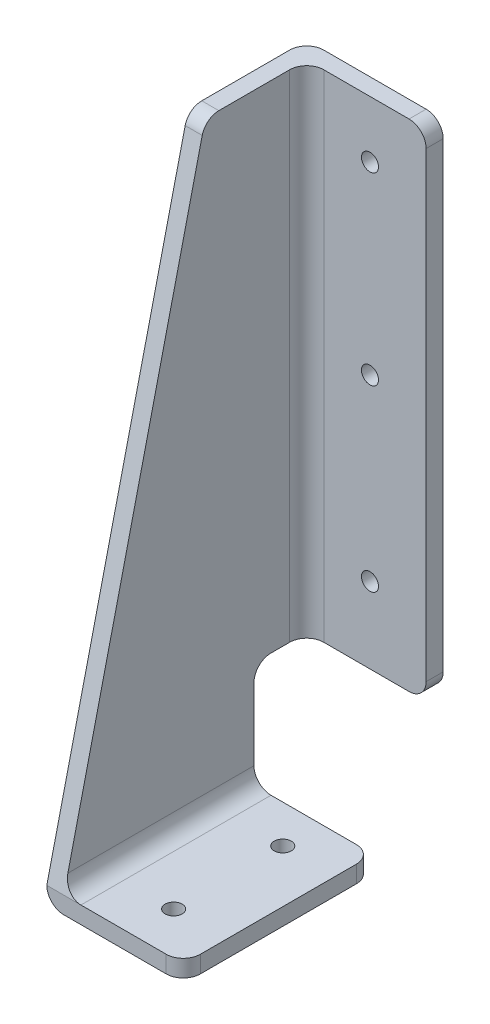
ISO-10303-21;
HEADER;
FILE_DESCRIPTION(('STEP AP214'),'2;1');
FILE_NAME('part.step','',(''),(''),'','','');
FILE_SCHEMA(('AUTOMOTIVE_DESIGN { 1 0 10303 214 1 1 1 1 }'));
ENDSEC;
DATA;
#1=APPLICATION_CONTEXT('core data for automotive mechanical design processes');
#2=APPLICATION_PROTOCOL_DEFINITION('international standard','automotive_design',2000,#1);
#3=PRODUCT_CONTEXT('',#1,'mechanical');
#4=PRODUCT('Part','Part','',(#3));
#5=PRODUCT_RELATED_PRODUCT_CATEGORY('part','',(#4));
#6=PRODUCT_DEFINITION_FORMATION('','',#4);
#7=PRODUCT_DEFINITION_CONTEXT('part definition',#1,'design');
#8=PRODUCT_DEFINITION('design','',#6,#7);
#9=PRODUCT_DEFINITION_SHAPE('','',#8);
#10=(LENGTH_UNIT() NAMED_UNIT(*) SI_UNIT(.MILLI.,.METRE.));
#11=(NAMED_UNIT(*) PLANE_ANGLE_UNIT() SI_UNIT($,.RADIAN.));
#12=(NAMED_UNIT(*) SI_UNIT($,.STERADIAN.) SOLID_ANGLE_UNIT());
#13=UNCERTAINTY_MEASURE_WITH_UNIT(LENGTH_MEASURE(1.E-05),#10,'distance_accuracy_value','');
#14=(GEOMETRIC_REPRESENTATION_CONTEXT(3) GLOBAL_UNCERTAINTY_ASSIGNED_CONTEXT((#13)) GLOBAL_UNIT_ASSIGNED_CONTEXT((#10,
#11,#12)) REPRESENTATION_CONTEXT('',''));
#15=CARTESIAN_POINT('',(0.,0.,0.));
#16=DIRECTION('',(0.,0.,1.));
#17=DIRECTION('',(1.,0.,0.));
#18=AXIS2_PLACEMENT_3D('',#15,#16,#17);
#19=CARTESIAN_POINT('',(-150.,37.1958630641374,158.305593200969));
#20=DIRECTION('',(0.,0.228733344690251,0.973489115001709));
#21=DIRECTION('',(0.,-0.973489115001709,0.228733344690251));
#22=AXIS2_PLACEMENT_3D('',#19,#20,#21);
#23=PLANE('',#22);
#24=DIRECTION('',(0.,-0.973489115001709,0.228733344690251));
#25=VECTOR('',#24,1.);
#26=CARTESIAN_POINT('',(-140.,37.1958630641374,158.305593200969));
#27=LINE('',#26,#25);
#28=CARTESIAN_POINT('',(-140.,365.139019254695,81.25128018627));
#29=VERTEX_POINT('',#28);
#30=CARTESIAN_POINT('',(-140.,30.,159.996350499873));
#31=VERTEX_POINT('',#30);
#32=EDGE_CURVE('E324',#29,#31,#27,.T.);
#33=ORIENTED_EDGE('',*,*,#32,.F.);
#34=DIRECTION('',(1.,0.,0.));
#35=VECTOR('',#34,1.);
#36=CARTESIAN_POINT('',(-150.,365.139019254695,81.25128018627));
#37=LINE('',#36,#35);
#38=CARTESIAN_POINT('',(-150.,365.139019254695,81.25128018627));
#39=VERTEX_POINT('',#38);
#40=EDGE_CURVE('E199',#29,#39,#37,.F.);
#41=ORIENTED_EDGE('',*,*,#40,.T.);
#42=DIRECTION('',(0.,-0.973489115001709,0.228733344690251));
#43=VECTOR('',#42,1.);
#44=CARTESIAN_POINT('',(-150.,37.1958630641374,158.305593200969));
#45=LINE('',#44,#43);
#46=CARTESIAN_POINT('',(-150.,20.,162.345974560024));
#47=VERTEX_POINT('',#46);
#48=EDGE_CURVE('E183',#39,#47,#45,.T.);
#49=ORIENTED_EDGE('',*,*,#48,.T.);
#50=DIRECTION('',(1.,0.,0.));
#51=VECTOR('',#50,1.);
#52=CARTESIAN_POINT('',(-150.,20.,162.345974560024));
#53=LINE('',#52,#51);
#54=CARTESIAN_POINT('',(-130.,20.,162.345974560024));
#55=VERTEX_POINT('',#54);
#56=EDGE_CURVE('E196',#47,#55,#53,.T.);
#57=ORIENTED_EDGE('',*,*,#56,.T.);
#58=CARTESIAN_POINT('',(-130.,30.,159.996350499873));
#59=DIRECTION('',(0.,0.228733344690251,0.973489115001709));
#60=DIRECTION('',(0.,-0.973489115001709,0.228733344690251));
#61=AXIS2_PLACEMENT_3D('',#58,#59,#60);
#62=ELLIPSE('',#61,10.27232852006,10.);
#63=EDGE_CURVE('E241',#55,#31,#62,.F.);
#64=ORIENTED_EDGE('',*,*,#63,.T.);
#65=EDGE_LOOP('',(#33,#41,#49,#57,#64));
#66=FACE_BOUND('',#65,.T.);
#67=ADVANCED_FACE('F44',(#66),#23,.T.);
#68=CARTESIAN_POINT('',(-130.,30.,0.));
#69=DIRECTION('',(0.,0.,1.));
#70=DIRECTION('',(1.,0.,0.));
#71=AXIS2_PLACEMENT_3D('',#68,#69,#70);
#72=CYLINDRICAL_SURFACE('',#71,10.);
#73=ORIENTED_EDGE('',*,*,#63,.F.);
#74=DIRECTION('',(0.,0.,-1.));
#75=VECTOR('',#74,1.);
#76=CARTESIAN_POINT('',(-130.,20.,162.345974560024));
#77=LINE('',#76,#75);
#78=CARTESIAN_POINT('',(-130.,20.,50.9191264101943));
#79=VERTEX_POINT('',#78);
#80=EDGE_CURVE('E340',#79,#55,#77,.F.);
#81=ORIENTED_EDGE('',*,*,#80,.F.);
#82=CARTESIAN_POINT('',(-130.,30.,50.9191264101943));
#83=DIRECTION('',(0.,0.,-1.));
#84=DIRECTION('',(-1.,0.,0.));
#85=AXIS2_PLACEMENT_3D('',#82,#83,#84);
#86=CIRCLE('',#85,10.);
#87=CARTESIAN_POINT('',(-140.,30.,50.9191264101943));
#88=VERTEX_POINT('',#87);
#89=EDGE_CURVE('E239',#88,#79,#86,.F.);
#90=ORIENTED_EDGE('',*,*,#89,.F.);
#91=DIRECTION('',(0.,0.,-1.));
#92=VECTOR('',#91,1.);
#93=CARTESIAN_POINT('',(-140.,30.,50.9191264101943));
#94=LINE('',#93,#92);
#95=EDGE_CURVE('E333',#31,#88,#94,.T.);
#96=ORIENTED_EDGE('',*,*,#95,.F.);
#97=EDGE_LOOP('',(#73,#81,#90,#96));
#98=FACE_BOUND('',#97,.T.);
#99=ADVANCED_FACE('F398',(#98),#72,.F.);
#100=CARTESIAN_POINT('',(-150.,72.1964727267462,40.9191264101943));
#101=DIRECTION('',(-1.,0.,0.));
#102=DIRECTION('',(0.,0.,1.));
#103=AXIS2_PLACEMENT_3D('',#100,#101,#102);
#104=CYLINDRICAL_SURFACE('',#103,10.);
#105=CARTESIAN_POINT('',(-150.,72.1964727267462,40.9191264101943));
#106=DIRECTION('',(1.,0.,0.));
#107=DIRECTION('',(0.,0.,-1.));
#108=AXIS2_PLACEMENT_3D('',#105,#106,#107);
#109=CIRCLE('',#108,10.);
#110=CARTESIAN_POINT('',(-150.,82.1964727267462,40.9191264101943));
#111=VERTEX_POINT('',#110);
#112=CARTESIAN_POINT('',(-150.,72.1964727267462,50.9191264101943));
#113=VERTEX_POINT('',#112);
#114=EDGE_CURVE('E245',#111,#113,#109,.T.);
#115=ORIENTED_EDGE('',*,*,#114,.F.);
#116=DIRECTION('',(1.,0.,0.));
#117=VECTOR('',#116,1.);
#118=CARTESIAN_POINT('',(-150.,82.1964727267462,40.9191264101943));
#119=LINE('',#118,#117);
#120=CARTESIAN_POINT('',(-140.,82.1964727267462,40.9191264101943));
#121=VERTEX_POINT('',#120);
#122=EDGE_CURVE('E360',#121,#111,#119,.F.);
#123=ORIENTED_EDGE('',*,*,#122,.F.);
#124=CARTESIAN_POINT('',(-140.,72.1964727267462,40.9191264101943));
#125=DIRECTION('',(1.,0.,0.));
#126=DIRECTION('',(0.,0.,-1.));
#127=AXIS2_PLACEMENT_3D('',#124,#125,#126);
#128=CIRCLE('',#127,10.);
#129=CARTESIAN_POINT('',(-140.,72.1964727267462,50.9191264101943));
#130=VERTEX_POINT('',#129);
#131=EDGE_CURVE('E243',#130,#121,#128,.F.);
#132=ORIENTED_EDGE('',*,*,#131,.F.);
#133=DIRECTION('',(1.,0.,0.));
#134=VECTOR('',#133,1.);
#135=CARTESIAN_POINT('',(-140.,72.1964727267462,50.9191264101943));
#136=LINE('',#135,#134);
#137=EDGE_CURVE('E368',#113,#130,#136,.T.);
#138=ORIENTED_EDGE('',*,*,#137,.F.);
#139=EDGE_LOOP('',(#115,#123,#132,#138));
#140=FACE_BOUND('',#139,.T.);
#141=ADVANCED_FACE('F443',(#140),#104,.F.);
#142=CARTESIAN_POINT('',(-130.,0.,30.));
#143=DIRECTION('',(0.,-1.,0.));
#144=DIRECTION('',(0.,0.,-1.));
#145=AXIS2_PLACEMENT_3D('',#142,#143,#144);
#146=CYLINDRICAL_SURFACE('',#145,10.);
#147=CARTESIAN_POINT('',(-130.,82.1964727267462,30.));
#148=DIRECTION('',(0.,-1.,0.));
#149=DIRECTION('',(0.,0.,-1.));
#150=AXIS2_PLACEMENT_3D('',#147,#148,#149);
#151=CIRCLE('',#150,10.);
#152=CARTESIAN_POINT('',(-130.,82.1964727267462,20.));
#153=VERTEX_POINT('',#152);
#154=CARTESIAN_POINT('',(-140.,82.1964727267462,30.));
#155=VERTEX_POINT('',#154);
#156=EDGE_CURVE('E11',#153,#155,#151,.F.);
#157=ORIENTED_EDGE('',*,*,#156,.F.);
#158=DIRECTION('',(0.,1.,0.));
#159=VECTOR('',#158,1.);
#160=CARTESIAN_POINT('',(-130.,82.1964727267462,20.));
#161=LINE('',#160,#159);
#162=CARTESIAN_POINT('',(-130.,372.851685807793,20.));
#163=VERTEX_POINT('',#162);
#164=EDGE_CURVE('E234',#163,#153,#161,.F.);
#165=ORIENTED_EDGE('',*,*,#164,.F.);
#166=CARTESIAN_POINT('',(-130.,372.851685807793,30.));
#167=DIRECTION('',(0.,1.,0.));
#168=DIRECTION('',(0.,0.,1.));
#169=AXIS2_PLACEMENT_3D('',#166,#167,#168);
#170=CIRCLE('',#169,10.);
#171=CARTESIAN_POINT('',(-140.,372.851685807793,30.));
#172=VERTEX_POINT('',#171);
#173=EDGE_CURVE('E54',#172,#163,#170,.F.);
#174=ORIENTED_EDGE('',*,*,#173,.F.);
#175=DIRECTION('',(0.,1.,0.));
#176=VECTOR('',#175,1.);
#177=CARTESIAN_POINT('',(-140.,372.851685807793,30.));
#178=LINE('',#177,#176);
#179=EDGE_CURVE('E330',#155,#172,#178,.T.);
#180=ORIENTED_EDGE('',*,*,#179,.F.);
#181=EDGE_LOOP('',(#157,#165,#174,#180));
#182=FACE_BOUND('',#181,.T.);
#183=ADVANCED_FACE('F439',(#182),#146,.F.);
#184=CARTESIAN_POINT('',(-140.,0.,0.));
#185=DIRECTION('',(1.,0.,0.));
#186=DIRECTION('',(0.,0.,-1.));
#187=AXIS2_PLACEMENT_3D('',#184,#185,#186);
#188=PLANE('',#187);
#189=ORIENTED_EDGE('',*,*,#32,.T.);
#190=ORIENTED_EDGE('',*,*,#95,.T.);
#191=DIRECTION('',(0.,1.,0.));
#192=VECTOR('',#191,1.);
#193=CARTESIAN_POINT('',(-140.,0.,50.9191264101943));
#194=LINE('',#193,#192);
#195=EDGE_CURVE('E315',#88,#130,#194,.T.);
#196=ORIENTED_EDGE('',*,*,#195,.T.);
#197=ORIENTED_EDGE('',*,*,#131,.T.);
#198=DIRECTION('',(0.,0.,-1.));
#199=VECTOR('',#198,1.);
#200=CARTESIAN_POINT('',(-140.,82.1964727267462,0.));
#201=LINE('',#200,#199);
#202=EDGE_CURVE('E311',#121,#155,#201,.T.);
#203=ORIENTED_EDGE('',*,*,#202,.T.);
#204=ORIENTED_EDGE('',*,*,#179,.T.);
#205=DIRECTION('',(0.,0.,1.));
#206=VECTOR('',#205,1.);
#207=CARTESIAN_POINT('',(-140.,372.851685807793,0.));
#208=LINE('',#207,#206);
#209=CARTESIAN_POINT('',(-140.,372.851685807793,71.5163890362529));
#210=VERTEX_POINT('',#209);
#211=EDGE_CURVE('E321',#172,#210,#208,.T.);
#212=ORIENTED_EDGE('',*,*,#211,.T.);
#213=CARTESIAN_POINT('',(-140.,362.851685807793,71.5163890362529));
#214=DIRECTION('',(1.,0.,0.));
#215=DIRECTION('',(0.,0.,-1.));
#216=AXIS2_PLACEMENT_3D('',#213,#214,#215);
#217=CIRCLE('',#216,10.);
#218=EDGE_CURVE('E211',#210,#29,#217,.T.);
#219=ORIENTED_EDGE('',*,*,#218,.T.);
#220=EDGE_LOOP('',(#189,#190,#196,#197,#203,#204,#212,#219));
#221=FACE_BOUND('',#220,.T.);
#222=ADVANCED_FACE('F401',(#221),#188,.T.);
#223=CARTESIAN_POINT('',(-150.,362.851685807793,71.5163890362529));
#224=DIRECTION('',(1.,0.,0.));
#225=DIRECTION('',(0.,0.,-1.));
#226=AXIS2_PLACEMENT_3D('',#223,#224,#225);
#227=CYLINDRICAL_SURFACE('',#226,10.);
#228=CARTESIAN_POINT('',(-150.,362.851685807793,71.5163890362529));
#229=DIRECTION('',(1.,0.,0.));
#230=DIRECTION('',(0.,0.,-1.));
#231=AXIS2_PLACEMENT_3D('',#228,#229,#230);
#232=CIRCLE('',#231,10.);
#233=CARTESIAN_POINT('',(-150.,372.851685807793,71.5163890362529));
#234=VERTEX_POINT('',#233);
#235=EDGE_CURVE('E190',#39,#234,#232,.F.);
#236=ORIENTED_EDGE('',*,*,#235,.F.);
#237=ORIENTED_EDGE('',*,*,#40,.F.);
#238=ORIENTED_EDGE('',*,*,#218,.F.);
#239=DIRECTION('',(1.,0.,0.));
#240=VECTOR('',#239,1.);
#241=CARTESIAN_POINT('',(-150.,372.851685807793,71.5163890362529));
#242=LINE('',#241,#240);
#243=EDGE_CURVE('E351',#234,#210,#242,.T.);
#244=ORIENTED_EDGE('',*,*,#243,.F.);
#245=EDGE_LOOP('',(#236,#237,#238,#244));
#246=FACE_BOUND('',#245,.T.);
#247=ADVANCED_FACE('F406',(#246),#227,.T.);
#248=CARTESIAN_POINT('',(-150.,0.,0.));
#249=DIRECTION('',(1.,0.,0.));
#250=DIRECTION('',(0.,0.,-1.));
#251=AXIS2_PLACEMENT_3D('',#248,#249,#250);
#252=PLANE('',#251);
#253=DIRECTION('',(0.,0.,1.));
#254=VECTOR('',#253,1.);
#255=CARTESIAN_POINT('',(-150.,372.851685807793,0.));
#256=LINE('',#255,#254);
#257=CARTESIAN_POINT('',(-150.,372.851685807793,20.));
#258=VERTEX_POINT('',#257);
#259=EDGE_CURVE('E200',#258,#234,#256,.T.);
#260=ORIENTED_EDGE('',*,*,#259,.F.);
#261=DIRECTION('',(0.,1.,0.));
#262=VECTOR('',#261,1.);
#263=CARTESIAN_POINT('',(-150.,0.,20.));
#264=LINE('',#263,#262);
#265=CARTESIAN_POINT('',(-150.,82.1964727267462,20.));
#266=VERTEX_POINT('',#265);
#267=EDGE_CURVE('E189',#258,#266,#264,.F.);
#268=ORIENTED_EDGE('',*,*,#267,.T.);
#269=DIRECTION('',(0.,0.,-1.));
#270=VECTOR('',#269,1.);
#271=CARTESIAN_POINT('',(-150.,82.1964727267462,0.));
#272=LINE('',#271,#270);
#273=EDGE_CURVE('E312',#111,#266,#272,.T.);
#274=ORIENTED_EDGE('',*,*,#273,.F.);
#275=ORIENTED_EDGE('',*,*,#114,.T.);
#276=DIRECTION('',(0.,1.,0.));
#277=VECTOR('',#276,1.);
#278=CARTESIAN_POINT('',(-150.,0.,50.9191264101943));
#279=LINE('',#278,#277);
#280=CARTESIAN_POINT('',(-150.,20.,50.9191264101943));
#281=VERTEX_POINT('',#280);
#282=EDGE_CURVE('E186',#281,#113,#279,.T.);
#283=ORIENTED_EDGE('',*,*,#282,.F.);
#284=DIRECTION('',(0.,0.,-1.));
#285=VECTOR('',#284,1.);
#286=CARTESIAN_POINT('',(-150.,20.,0.));
#287=LINE('',#286,#285);
#288=EDGE_CURVE('E179',#281,#47,#287,.F.);
#289=ORIENTED_EDGE('',*,*,#288,.T.);
#290=ORIENTED_EDGE('',*,*,#48,.F.);
#291=ORIENTED_EDGE('',*,*,#235,.T.);
#292=EDGE_LOOP('',(#260,#268,#274,#275,#283,#289,#290,#291));
#293=FACE_BOUND('',#292,.T.);
#294=ADVANCED_FACE('F182',(#293),#252,.F.);
#295=CARTESIAN_POINT('',(-70.,0.,0.));
#296=DIRECTION('',(1.,0.,0.));
#297=DIRECTION('',(0.,0.,-1.));
#298=AXIS2_PLACEMENT_3D('',#295,#296,#297);
#299=PLANE('',#298);
#300=DIRECTION('',(0.,0.,-1.));
#301=VECTOR('',#300,1.);
#302=CARTESIAN_POINT('',(-70.,10.,0.));
#303=LINE('',#302,#301);
#304=CARTESIAN_POINT('',(-70.,10.,152.345974560024));
#305=VERTEX_POINT('',#304);
#306=CARTESIAN_POINT('',(-70.,10.,60.9191264101943));
#307=VERTEX_POINT('',#306);
#308=EDGE_CURVE('E299',#305,#307,#303,.T.);
#309=ORIENTED_EDGE('',*,*,#308,.T.);
#310=DIRECTION('',(0.,1.,0.));
#311=VECTOR('',#310,1.);
#312=CARTESIAN_POINT('',(-70.,0.,60.9191264101943));
#313=LINE('',#312,#311);
#314=CARTESIAN_POINT('',(-70.,20.,60.9191264101943));
#315=VERTEX_POINT('',#314);
#316=EDGE_CURVE('E221',#307,#315,#313,.T.);
#317=ORIENTED_EDGE('',*,*,#316,.T.);
#318=DIRECTION('',(0.,0.,-1.));
#319=VECTOR('',#318,1.);
#320=CARTESIAN_POINT('',(-70.,20.,0.));
#321=LINE('',#320,#319);
#322=CARTESIAN_POINT('',(-70.,20.,152.345974560024));
#323=VERTEX_POINT('',#322);
#324=EDGE_CURVE('E296',#323,#315,#321,.T.);
#325=ORIENTED_EDGE('',*,*,#324,.F.);
#326=DIRECTION('',(0.,-1.,0.));
#327=VECTOR('',#326,1.);
#328=CARTESIAN_POINT('',(-70.,10.,152.345974560024));
#329=LINE('',#328,#327);
#330=EDGE_CURVE('E217',#323,#305,#329,.T.);
#331=ORIENTED_EDGE('',*,*,#330,.T.);
#332=EDGE_LOOP('',(#309,#317,#325,#331));
#333=FACE_BOUND('',#332,.T.);
#334=ADVANCED_FACE('F387',(#333),#299,.T.);
#335=CARTESIAN_POINT('',(-70.,0.,162.345974560024));
#336=DIRECTION('',(0.,0.,-1.));
#337=DIRECTION('',(-1.,0.,0.));
#338=AXIS2_PLACEMENT_3D('',#335,#336,#337);
#339=PLANE('',#338);
#340=ORIENTED_EDGE('',*,*,#56,.F.);
#341=CARTESIAN_POINT('',(-140.,20.,162.345974560024));
#342=DIRECTION('',(0.,0.,-1.));
#343=DIRECTION('',(-1.,0.,0.));
#344=AXIS2_PLACEMENT_3D('',#341,#342,#343);
#345=CIRCLE('',#344,10.);
#346=CARTESIAN_POINT('',(-140.,10.,162.345974560024));
#347=VERTEX_POINT('',#346);
#348=EDGE_CURVE('E206',#47,#347,#345,.F.);
#349=ORIENTED_EDGE('',*,*,#348,.T.);
#350=DIRECTION('',(-1.,0.,0.));
#351=VECTOR('',#350,1.);
#352=CARTESIAN_POINT('',(-70.,10.,162.345974560024));
#353=LINE('',#352,#351);
#354=CARTESIAN_POINT('',(-80.,10.,162.345974560024));
#355=VERTEX_POINT('',#354);
#356=EDGE_CURVE('E308',#355,#347,#353,.T.);
#357=ORIENTED_EDGE('',*,*,#356,.F.);
#358=DIRECTION('',(0.,-1.,0.));
#359=VECTOR('',#358,1.);
#360=CARTESIAN_POINT('',(-80.,20.,162.345974560024));
#361=LINE('',#360,#359);
#362=CARTESIAN_POINT('',(-80.,20.,162.345974560024));
#363=VERTEX_POINT('',#362);
#364=EDGE_CURVE('E218',#355,#363,#361,.F.);
#365=ORIENTED_EDGE('',*,*,#364,.T.);
#366=DIRECTION('',(-1.,0.,0.));
#367=VECTOR('',#366,1.);
#368=CARTESIAN_POINT('',(-70.,20.,162.345974560024));
#369=LINE('',#368,#367);
#370=EDGE_CURVE('E209',#363,#55,#369,.T.);
#371=ORIENTED_EDGE('',*,*,#370,.T.);
#372=EDGE_LOOP('',(#340,#349,#357,#365,#371));
#373=FACE_BOUND('',#372,.T.);
#374=ADVANCED_FACE('F204',(#373),#339,.F.);
#375=CARTESIAN_POINT('',(-70.,20.,0.));
#376=DIRECTION('',(0.,1.,0.));
#377=DIRECTION('',(0.,0.,1.));
#378=AXIS2_PLACEMENT_3D('',#375,#376,#377);
#379=PLANE('',#378);
#380=CARTESIAN_POINT('',(-100.798534583192,20.,73.2467031796124));
#381=DIRECTION('',(0.,1.,0.));
#382=DIRECTION('',(0.,0.,1.));
#383=AXIS2_PLACEMENT_3D('',#380,#381,#382);
#384=CIRCLE('',#383,4.99999999999999);
#385=CARTESIAN_POINT('',(-100.798534583192,20.,78.2467031796124));
#386=VERTEX_POINT('',#385);
#387=EDGE_CURVE('E264',#386,#386,#384,.T.);
#388=ORIENTED_EDGE('',*,*,#387,.F.);
#389=EDGE_LOOP('',(#388));
#390=FACE_BOUND('',#389,.T.);
#391=CARTESIAN_POINT('',(-100.798534583192,20.,137.208608221462));
#392=DIRECTION('',(0.,1.,0.));
#393=DIRECTION('',(0.,0.,1.));
#394=AXIS2_PLACEMENT_3D('',#391,#392,#393);
#395=CIRCLE('',#394,4.99999999999999);
#396=CARTESIAN_POINT('',(-100.798534583192,20.,142.208608221462));
#397=VERTEX_POINT('',#396);
#398=EDGE_CURVE('E254',#397,#397,#395,.T.);
#399=ORIENTED_EDGE('',*,*,#398,.F.);
#400=EDGE_LOOP('',(#399));
#401=FACE_BOUND('',#400,.T.);
#402=DIRECTION('',(-1.,0.,0.));
#403=VECTOR('',#402,1.);
#404=CARTESIAN_POINT('',(-70.,20.,50.9191264101943));
#405=LINE('',#404,#403);
#406=CARTESIAN_POINT('',(-80.,20.,50.9191264101943));
#407=VERTEX_POINT('',#406);
#408=EDGE_CURVE('E302',#407,#79,#405,.T.);
#409=ORIENTED_EDGE('',*,*,#408,.T.);
#410=ORIENTED_EDGE('',*,*,#80,.T.);
#411=ORIENTED_EDGE('',*,*,#370,.F.);
#412=CARTESIAN_POINT('',(-80.,20.,152.345974560024));
#413=DIRECTION('',(0.,1.,0.));
#414=DIRECTION('',(0.,0.,1.));
#415=AXIS2_PLACEMENT_3D('',#412,#413,#414);
#416=CIRCLE('',#415,10.);
#417=EDGE_CURVE('E336',#363,#323,#416,.T.);
#418=ORIENTED_EDGE('',*,*,#417,.T.);
#419=ORIENTED_EDGE('',*,*,#324,.T.);
#420=CARTESIAN_POINT('',(-80.,20.,60.9191264101943));
#421=DIRECTION('',(0.,1.,0.));
#422=DIRECTION('',(0.,0.,1.));
#423=AXIS2_PLACEMENT_3D('',#420,#421,#422);
#424=CIRCLE('',#423,10.);
#425=EDGE_CURVE('E338',#315,#407,#424,.T.);
#426=ORIENTED_EDGE('',*,*,#425,.T.);
#427=EDGE_LOOP('',(#409,#410,#411,#418,#419,#426));
#428=FACE_BOUND('',#427,.T.);
#429=ADVANCED_FACE('F395',(#390,#401,#428),#379,.T.);
#430=CARTESIAN_POINT('',(-100.798534583192,20.,73.2467031796124));
#431=DIRECTION('',(0.,1.,0.));
#432=DIRECTION('',(0.,0.,1.));
#433=AXIS2_PLACEMENT_3D('',#430,#431,#432);
#434=CYLINDRICAL_SURFACE('',#433,4.99999999999999);
#435=ORIENTED_EDGE('',*,*,#387,.T.);
#436=EDGE_LOOP('',(#435));
#437=FACE_BOUND('',#436,.T.);
#438=CARTESIAN_POINT('',(-100.798534583192,10.,73.2467031796124));
#439=DIRECTION('',(0.,1.,0.));
#440=DIRECTION('',(0.,0.,1.));
#441=AXIS2_PLACEMENT_3D('',#438,#439,#440);
#442=CIRCLE('',#441,4.99999999999999);
#443=CARTESIAN_POINT('',(-100.798534583192,10.,78.2467031796124));
#444=VERTEX_POINT('',#443);
#445=EDGE_CURVE('E48',#444,#444,#442,.T.);
#446=ORIENTED_EDGE('',*,*,#445,.F.);
#447=EDGE_LOOP('',(#446));
#448=FACE_BOUND('',#447,.T.);
#449=ADVANCED_FACE('F506',(#437,#448),#434,.F.);
#450=CARTESIAN_POINT('',(-100.798534583192,20.,137.208608221462));
#451=DIRECTION('',(0.,1.,0.));
#452=DIRECTION('',(0.,0.,1.));
#453=AXIS2_PLACEMENT_3D('',#450,#451,#452);
#454=CYLINDRICAL_SURFACE('',#453,4.99999999999999);
#455=ORIENTED_EDGE('',*,*,#398,.T.);
#456=EDGE_LOOP('',(#455));
#457=FACE_BOUND('',#456,.T.);
#458=CARTESIAN_POINT('',(-100.798534583192,10.,137.208608221462));
#459=DIRECTION('',(0.,1.,0.));
#460=DIRECTION('',(0.,0.,1.));
#461=AXIS2_PLACEMENT_3D('',#458,#459,#460);
#462=CIRCLE('',#461,4.99999999999999);
#463=CARTESIAN_POINT('',(-100.798534583192,10.,142.208608221462));
#464=VERTEX_POINT('',#463);
#465=EDGE_CURVE('E252',#464,#464,#462,.T.);
#466=ORIENTED_EDGE('',*,*,#465,.F.);
#467=EDGE_LOOP('',(#466));
#468=FACE_BOUND('',#467,.T.);
#469=ADVANCED_FACE('F491',(#457,#468),#454,.F.);
#470=CARTESIAN_POINT('',(-80.,0.,152.345974560024));
#471=DIRECTION('',(0.,1.,0.));
#472=DIRECTION('',(0.,0.,1.));
#473=AXIS2_PLACEMENT_3D('',#470,#471,#472);
#474=CYLINDRICAL_SURFACE('',#473,10.);
#475=ORIENTED_EDGE('',*,*,#417,.F.);
#476=ORIENTED_EDGE('',*,*,#364,.F.);
#477=CARTESIAN_POINT('',(-80.,10.,152.345974560024));
#478=DIRECTION('',(0.,1.,0.));
#479=DIRECTION('',(0.,0.,1.));
#480=AXIS2_PLACEMENT_3D('',#477,#478,#479);
#481=CIRCLE('',#480,10.);
#482=EDGE_CURVE('E371',#305,#355,#481,.F.);
#483=ORIENTED_EDGE('',*,*,#482,.F.);
#484=ORIENTED_EDGE('',*,*,#330,.F.);
#485=EDGE_LOOP('',(#475,#476,#483,#484));
#486=FACE_BOUND('',#485,.T.);
#487=ADVANCED_FACE('F392',(#486),#474,.T.);
#488=CARTESIAN_POINT('',(-150.,0.,50.9191264101943));
#489=DIRECTION('',(0.,0.,-1.));
#490=DIRECTION('',(-1.,0.,0.));
#491=AXIS2_PLACEMENT_3D('',#488,#489,#490);
#492=PLANE('',#491);
#493=ORIENTED_EDGE('',*,*,#282,.T.);
#494=ORIENTED_EDGE('',*,*,#137,.T.);
#495=ORIENTED_EDGE('',*,*,#195,.F.);
#496=ORIENTED_EDGE('',*,*,#89,.T.);
#497=ORIENTED_EDGE('',*,*,#408,.F.);
#498=DIRECTION('',(0.,1.,0.));
#499=VECTOR('',#498,1.);
#500=CARTESIAN_POINT('',(-80.,0.,50.9191264101943));
#501=LINE('',#500,#499);
#502=CARTESIAN_POINT('',(-80.,10.,50.9191264101943));
#503=VERTEX_POINT('',#502);
#504=EDGE_CURVE('E364',#407,#503,#501,.F.);
#505=ORIENTED_EDGE('',*,*,#504,.T.);
#506=DIRECTION('',(-1.,0.,0.));
#507=VECTOR('',#506,1.);
#508=CARTESIAN_POINT('',(-70.,10.,50.9191264101943));
#509=LINE('',#508,#507);
#510=CARTESIAN_POINT('',(-140.,10.,50.9191264101943));
#511=VERTEX_POINT('',#510);
#512=EDGE_CURVE('E305',#503,#511,#509,.T.);
#513=ORIENTED_EDGE('',*,*,#512,.T.);
#514=CARTESIAN_POINT('',(-140.,20.,50.9191264101943));
#515=DIRECTION('',(0.,0.,-1.));
#516=DIRECTION('',(-1.,0.,0.));
#517=AXIS2_PLACEMENT_3D('',#514,#515,#516);
#518=CIRCLE('',#517,10.);
#519=EDGE_CURVE('E366',#511,#281,#518,.T.);
#520=ORIENTED_EDGE('',*,*,#519,.T.);
#521=EDGE_LOOP('',(#493,#494,#495,#496,#497,#505,#513,#520));
#522=FACE_BOUND('',#521,.T.);
#523=ADVANCED_FACE('F379',(#522),#492,.T.);
#524=CARTESIAN_POINT('',(-80.,0.,60.9191264101943));
#525=DIRECTION('',(0.,1.,0.));
#526=DIRECTION('',(0.,0.,1.));
#527=AXIS2_PLACEMENT_3D('',#524,#525,#526);
#528=CYLINDRICAL_SURFACE('',#527,10.);
#529=CARTESIAN_POINT('',(-80.,10.,60.9191264101943));
#530=DIRECTION('',(0.,1.,0.));
#531=DIRECTION('',(0.,0.,1.));
#532=AXIS2_PLACEMENT_3D('',#529,#530,#531);
#533=CIRCLE('',#532,10.);
#534=EDGE_CURVE('E373',#503,#307,#533,.F.);
#535=ORIENTED_EDGE('',*,*,#534,.F.);
#536=ORIENTED_EDGE('',*,*,#504,.F.);
#537=ORIENTED_EDGE('',*,*,#425,.F.);
#538=ORIENTED_EDGE('',*,*,#316,.F.);
#539=EDGE_LOOP('',(#535,#536,#537,#538));
#540=FACE_BOUND('',#539,.T.);
#541=ADVANCED_FACE('F383',(#540),#528,.T.);
#542=CARTESIAN_POINT('',(-140.,20.,0.));
#543=DIRECTION('',(0.,0.,-1.));
#544=DIRECTION('',(0.,1.,0.));
#545=AXIS2_PLACEMENT_3D('',#542,#543,#544);
#546=CYLINDRICAL_SURFACE('',#545,10.);
#547=ORIENTED_EDGE('',*,*,#348,.F.);
#548=ORIENTED_EDGE('',*,*,#288,.F.);
#549=ORIENTED_EDGE('',*,*,#519,.F.);
#550=DIRECTION('',(0.,0.,-1.));
#551=VECTOR('',#550,1.);
#552=CARTESIAN_POINT('',(-140.,10.,0.));
#553=LINE('',#552,#551);
#554=EDGE_CURVE('E216',#347,#511,#553,.T.);
#555=ORIENTED_EDGE('',*,*,#554,.F.);
#556=EDGE_LOOP('',(#547,#548,#549,#555));
#557=FACE_BOUND('',#556,.T.);
#558=ADVANCED_FACE('F214',(#557),#546,.T.);
#559=CARTESIAN_POINT('',(-150.,82.1964727267462,0.));
#560=DIRECTION('',(0.,-1.,0.));
#561=DIRECTION('',(0.,0.,-1.));
#562=AXIS2_PLACEMENT_3D('',#559,#560,#561);
#563=PLANE('',#562);
#564=ORIENTED_EDGE('',*,*,#273,.T.);
#565=CARTESIAN_POINT('',(-140.,82.1964727267462,20.));
#566=DIRECTION('',(0.,-1.,0.));
#567=DIRECTION('',(0.,0.,-1.));
#568=AXIS2_PLACEMENT_3D('',#565,#566,#567);
#569=CIRCLE('',#568,10.);
#570=CARTESIAN_POINT('',(-140.,82.1964727267462,10.));
#571=VERTEX_POINT('',#570);
#572=EDGE_CURVE('E362',#266,#571,#569,.T.);
#573=ORIENTED_EDGE('',*,*,#572,.T.);
#574=DIRECTION('',(-1.,0.,0.));
#575=VECTOR('',#574,1.);
#576=CARTESIAN_POINT('',(-70.,82.1964727267462,10.));
#577=LINE('',#576,#575);
#578=CARTESIAN_POINT('',(-80.,82.1964727267462,10.));
#579=VERTEX_POINT('',#578);
#580=EDGE_CURVE('E290',#579,#571,#577,.T.);
#581=ORIENTED_EDGE('',*,*,#580,.F.);
#582=DIRECTION('',(0.,0.,-1.));
#583=VECTOR('',#582,1.);
#584=CARTESIAN_POINT('',(-80.,82.1964727267462,0.));
#585=LINE('',#584,#583);
#586=CARTESIAN_POINT('',(-80.,82.1964727267462,20.));
#587=VERTEX_POINT('',#586);
#588=EDGE_CURVE('E358',#579,#587,#585,.F.);
#589=ORIENTED_EDGE('',*,*,#588,.T.);
#590=DIRECTION('',(-1.,0.,0.));
#591=VECTOR('',#590,1.);
#592=CARTESIAN_POINT('',(-70.,82.1964727267462,20.));
#593=LINE('',#592,#591);
#594=EDGE_CURVE('E293',#587,#153,#593,.T.);
#595=ORIENTED_EDGE('',*,*,#594,.T.);
#596=ORIENTED_EDGE('',*,*,#156,.T.);
#597=ORIENTED_EDGE('',*,*,#202,.F.);
#598=ORIENTED_EDGE('',*,*,#122,.T.);
#599=EDGE_LOOP('',(#564,#573,#581,#589,#595,#596,#597,#598));
#600=FACE_BOUND('',#599,.T.);
#601=ADVANCED_FACE('F417',(#600),#563,.T.);
#602=CARTESIAN_POINT('',(-70.,0.,0.));
#603=DIRECTION('',(1.,0.,0.));
#604=DIRECTION('',(0.,0.,-1.));
#605=AXIS2_PLACEMENT_3D('',#602,#603,#604);
#606=PLANE('',#605);
#607=DIRECTION('',(0.,1.,0.));
#608=VECTOR('',#607,1.);
#609=CARTESIAN_POINT('',(-70.,0.,20.));
#610=LINE('',#609,#608);
#611=CARTESIAN_POINT('',(-70.,92.1964727267462,20.));
#612=VERTEX_POINT('',#611);
#613=CARTESIAN_POINT('',(-70.,362.851685807793,20.));
#614=VERTEX_POINT('',#613);
#615=EDGE_CURVE('E278',#612,#614,#610,.T.);
#616=ORIENTED_EDGE('',*,*,#615,.F.);
#617=DIRECTION('',(0.,0.,-1.));
#618=VECTOR('',#617,1.);
#619=CARTESIAN_POINT('',(-70.,92.1964727267462,0.));
#620=LINE('',#619,#618);
#621=CARTESIAN_POINT('',(-70.,92.1964727267462,10.));
#622=VERTEX_POINT('',#621);
#623=EDGE_CURVE('E230',#612,#622,#620,.T.);
#624=ORIENTED_EDGE('',*,*,#623,.T.);
#625=DIRECTION('',(0.,1.,0.));
#626=VECTOR('',#625,1.);
#627=CARTESIAN_POINT('',(-70.,0.,10.));
#628=LINE('',#627,#626);
#629=CARTESIAN_POINT('',(-70.,362.851685807793,10.));
#630=VERTEX_POINT('',#629);
#631=EDGE_CURVE('E281',#622,#630,#628,.T.);
#632=ORIENTED_EDGE('',*,*,#631,.T.);
#633=DIRECTION('',(0.,0.,1.));
#634=VECTOR('',#633,1.);
#635=CARTESIAN_POINT('',(-70.,362.851685807793,0.));
#636=LINE('',#635,#634);
#637=EDGE_CURVE('E228',#630,#614,#636,.T.);
#638=ORIENTED_EDGE('',*,*,#637,.T.);
#639=EDGE_LOOP('',(#616,#624,#632,#638));
#640=FACE_BOUND('',#639,.T.);
#641=ADVANCED_FACE('F429',(#640),#606,.T.);
#642=CARTESIAN_POINT('',(-70.,0.,20.));
#643=DIRECTION('',(0.,0.,1.));
#644=DIRECTION('',(1.,0.,0.));
#645=AXIS2_PLACEMENT_3D('',#642,#643,#644);
#646=PLANE('',#645);
#647=CARTESIAN_POINT('',(-102.908891555727,339.53943154897,20.));
#648=DIRECTION('',(0.,0.,1.));
#649=DIRECTION('',(1.,0.,0.));
#650=AXIS2_PLACEMENT_3D('',#647,#648,#649);
#651=CIRCLE('',#650,4.99999999999999);
#652=CARTESIAN_POINT('',(-97.908891555727,339.53943154897,20.));
#653=VERTEX_POINT('',#652);
#654=EDGE_CURVE('E251',#653,#653,#651,.T.);
#655=ORIENTED_EDGE('',*,*,#654,.F.);
#656=EDGE_LOOP('',(#655));
#657=FACE_BOUND('',#656,.T.);
#658=CARTESIAN_POINT('',(-102.908891555727,231.428858641695,20.));
#659=DIRECTION('',(0.,0.,1.));
#660=DIRECTION('',(1.,0.,0.));
#661=AXIS2_PLACEMENT_3D('',#658,#659,#660);
#662=CIRCLE('',#661,4.99999999999999);
#663=CARTESIAN_POINT('',(-97.908891555727,231.428858641695,20.));
#664=VERTEX_POINT('',#663);
#665=EDGE_CURVE('E250',#664,#664,#662,.T.);
#666=ORIENTED_EDGE('',*,*,#665,.F.);
#667=EDGE_LOOP('',(#666));
#668=FACE_BOUND('',#667,.T.);
#669=CARTESIAN_POINT('',(-102.908891555727,126.634560976974,20.));
#670=DIRECTION('',(0.,0.,1.));
#671=DIRECTION('',(1.,0.,0.));
#672=AXIS2_PLACEMENT_3D('',#669,#670,#671);
#673=CIRCLE('',#672,4.99999999999999);
#674=CARTESIAN_POINT('',(-97.908891555727,126.634560976974,20.));
#675=VERTEX_POINT('',#674);
#676=EDGE_CURVE('E272',#675,#675,#673,.T.);
#677=ORIENTED_EDGE('',*,*,#676,.F.);
#678=EDGE_LOOP('',(#677));
#679=FACE_BOUND('',#678,.T.);
#680=ORIENTED_EDGE('',*,*,#594,.F.);
#681=CARTESIAN_POINT('',(-80.,92.1964727267462,20.));
#682=DIRECTION('',(0.,0.,1.));
#683=DIRECTION('',(1.,0.,0.));
#684=AXIS2_PLACEMENT_3D('',#681,#682,#683);
#685=CIRCLE('',#684,10.);
#686=EDGE_CURVE('E236',#587,#612,#685,.T.);
#687=ORIENTED_EDGE('',*,*,#686,.T.);
#688=ORIENTED_EDGE('',*,*,#615,.T.);
#689=CARTESIAN_POINT('',(-80.,362.851685807793,20.));
#690=DIRECTION('',(0.,0.,1.));
#691=DIRECTION('',(1.,0.,0.));
#692=AXIS2_PLACEMENT_3D('',#689,#690,#691);
#693=CIRCLE('',#692,10.);
#694=CARTESIAN_POINT('',(-80.,372.851685807793,20.));
#695=VERTEX_POINT('',#694);
#696=EDGE_CURVE('E62',#614,#695,#693,.T.);
#697=ORIENTED_EDGE('',*,*,#696,.T.);
#698=DIRECTION('',(-1.,0.,0.));
#699=VECTOR('',#698,1.);
#700=CARTESIAN_POINT('',(-70.,372.851685807793,20.));
#701=LINE('',#700,#699);
#702=EDGE_CURVE('E284',#695,#163,#701,.T.);
#703=ORIENTED_EDGE('',*,*,#702,.T.);
#704=ORIENTED_EDGE('',*,*,#164,.T.);
#705=EDGE_LOOP('',(#680,#687,#688,#697,#703,#704));
#706=FACE_BOUND('',#705,.T.);
#707=ADVANCED_FACE('F432',(#657,#668,#679,#706),#646,.T.);
#708=CARTESIAN_POINT('',(-102.908891555727,339.53943154897,20.));
#709=DIRECTION('',(0.,0.,1.));
#710=DIRECTION('',(1.,0.,0.));
#711=AXIS2_PLACEMENT_3D('',#708,#709,#710);
#712=CYLINDRICAL_SURFACE('',#711,4.99999999999999);
#713=ORIENTED_EDGE('',*,*,#654,.T.);
#714=EDGE_LOOP('',(#713));
#715=FACE_BOUND('',#714,.T.);
#716=CARTESIAN_POINT('',(-102.908891555727,339.53943154897,10.));
#717=DIRECTION('',(0.,0.,1.));
#718=DIRECTION('',(0.,-1.,0.));
#719=AXIS2_PLACEMENT_3D('',#716,#717,#718);
#720=CIRCLE('',#719,4.99999999999999);
#721=CARTESIAN_POINT('',(-102.908891555727,334.53943154897,10.));
#722=VERTEX_POINT('',#721);
#723=EDGE_CURVE('E248',#722,#722,#720,.T.);
#724=ORIENTED_EDGE('',*,*,#723,.F.);
#725=EDGE_LOOP('',(#724));
#726=FACE_BOUND('',#725,.T.);
#727=ADVANCED_FACE('F518',(#715,#726),#712,.F.);
#728=CARTESIAN_POINT('',(-102.908891555727,231.428858641695,20.));
#729=DIRECTION('',(0.,0.,1.));
#730=DIRECTION('',(1.,0.,0.));
#731=AXIS2_PLACEMENT_3D('',#728,#729,#730);
#732=CYLINDRICAL_SURFACE('',#731,4.99999999999999);
#733=ORIENTED_EDGE('',*,*,#665,.T.);
#734=EDGE_LOOP('',(#733));
#735=FACE_BOUND('',#734,.T.);
#736=CARTESIAN_POINT('',(-102.908891555727,231.428858641695,10.));
#737=DIRECTION('',(0.,0.,1.));
#738=DIRECTION('',(0.,-1.,0.));
#739=AXIS2_PLACEMENT_3D('',#736,#737,#738);
#740=CIRCLE('',#739,4.99999999999999);
#741=CARTESIAN_POINT('',(-102.908891555727,226.428858641695,10.));
#742=VERTEX_POINT('',#741);
#743=EDGE_CURVE('E269',#742,#742,#740,.T.);
#744=ORIENTED_EDGE('',*,*,#743,.F.);
#745=EDGE_LOOP('',(#744));
#746=FACE_BOUND('',#745,.T.);
#747=ADVANCED_FACE('F523',(#735,#746),#732,.F.);
#748=CARTESIAN_POINT('',(-102.908891555727,126.634560976974,20.));
#749=DIRECTION('',(0.,0.,1.));
#750=DIRECTION('',(1.,0.,0.));
#751=AXIS2_PLACEMENT_3D('',#748,#749,#750);
#752=CYLINDRICAL_SURFACE('',#751,4.99999999999999);
#753=ORIENTED_EDGE('',*,*,#676,.T.);
#754=EDGE_LOOP('',(#753));
#755=FACE_BOUND('',#754,.T.);
#756=CARTESIAN_POINT('',(-102.908891555727,126.634560976974,10.));
#757=DIRECTION('',(0.,0.,1.));
#758=DIRECTION('',(0.,-1.,0.));
#759=AXIS2_PLACEMENT_3D('',#756,#757,#758);
#760=CIRCLE('',#759,4.99999999999999);
#761=CARTESIAN_POINT('',(-102.908891555727,121.634560976974,10.));
#762=VERTEX_POINT('',#761);
#763=EDGE_CURVE('E275',#762,#762,#760,.T.);
#764=ORIENTED_EDGE('',*,*,#763,.F.);
#765=EDGE_LOOP('',(#764));
#766=FACE_BOUND('',#765,.T.);
#767=ADVANCED_FACE('F477',(#755,#766),#752,.F.);
#768=CARTESIAN_POINT('',(-150.,372.851685807793,0.));
#769=DIRECTION('',(0.,1.,0.));
#770=DIRECTION('',(0.,0.,1.));
#771=AXIS2_PLACEMENT_3D('',#768,#769,#770);
#772=PLANE('',#771);
#773=DIRECTION('',(-1.,0.,0.));
#774=VECTOR('',#773,1.);
#775=CARTESIAN_POINT('',(-70.,372.851685807793,10.));
#776=LINE('',#775,#774);
#777=CARTESIAN_POINT('',(-80.,372.851685807793,10.));
#778=VERTEX_POINT('',#777);
#779=CARTESIAN_POINT('',(-140.,372.851685807793,10.));
#780=VERTEX_POINT('',#779);
#781=EDGE_CURVE('E287',#778,#780,#776,.T.);
#782=ORIENTED_EDGE('',*,*,#781,.T.);
#783=CARTESIAN_POINT('',(-140.,372.851685807793,20.));
#784=DIRECTION('',(0.,1.,0.));
#785=DIRECTION('',(0.,0.,1.));
#786=AXIS2_PLACEMENT_3D('',#783,#784,#785);
#787=CIRCLE('',#786,10.);
#788=EDGE_CURVE('E354',#780,#258,#787,.T.);
#789=ORIENTED_EDGE('',*,*,#788,.T.);
#790=ORIENTED_EDGE('',*,*,#259,.T.);
#791=ORIENTED_EDGE('',*,*,#243,.T.);
#792=ORIENTED_EDGE('',*,*,#211,.F.);
#793=ORIENTED_EDGE('',*,*,#173,.T.);
#794=ORIENTED_EDGE('',*,*,#702,.F.);
#795=DIRECTION('',(0.,0.,1.));
#796=VECTOR('',#795,1.);
#797=CARTESIAN_POINT('',(-80.,372.851685807793,0.));
#798=LINE('',#797,#796);
#799=EDGE_CURVE('E349',#695,#778,#798,.F.);
#800=ORIENTED_EDGE('',*,*,#799,.T.);
#801=EDGE_LOOP('',(#782,#789,#790,#791,#792,#793,#794,#800));
#802=FACE_BOUND('',#801,.T.);
#803=ADVANCED_FACE('F408',(#802),#772,.T.);
#804=CARTESIAN_POINT('',(-80.,362.851685807793,0.));
#805=DIRECTION('',(0.,0.,1.));
#806=DIRECTION('',(1.,0.,0.));
#807=AXIS2_PLACEMENT_3D('',#804,#805,#806);
#808=CYLINDRICAL_SURFACE('',#807,10.);
#809=CARTESIAN_POINT('',(-80.,362.851685807793,10.));
#810=DIRECTION('',(0.,0.,1.));
#811=DIRECTION('',(0.,-1.,0.));
#812=AXIS2_PLACEMENT_3D('',#809,#810,#811);
#813=CIRCLE('',#812,10.);
#814=EDGE_CURVE('E342',#778,#630,#813,.F.);
#815=ORIENTED_EDGE('',*,*,#814,.F.);
#816=ORIENTED_EDGE('',*,*,#799,.F.);
#817=ORIENTED_EDGE('',*,*,#696,.F.);
#818=ORIENTED_EDGE('',*,*,#637,.F.);
#819=EDGE_LOOP('',(#815,#816,#817,#818));
#820=FACE_BOUND('',#819,.T.);
#821=ADVANCED_FACE('F46',(#820),#808,.T.);
#822=CARTESIAN_POINT('',(-80.,92.1964727267462,0.));
#823=DIRECTION('',(0.,0.,-1.));
#824=DIRECTION('',(-1.,0.,0.));
#825=AXIS2_PLACEMENT_3D('',#822,#823,#824);
#826=CYLINDRICAL_SURFACE('',#825,10.);
#827=ORIENTED_EDGE('',*,*,#686,.F.);
#828=ORIENTED_EDGE('',*,*,#588,.F.);
#829=CARTESIAN_POINT('',(-80.,92.1964727267462,10.));
#830=DIRECTION('',(0.,0.,1.));
#831=DIRECTION('',(0.,-1.,0.));
#832=AXIS2_PLACEMENT_3D('',#829,#830,#831);
#833=CIRCLE('',#832,10.);
#834=EDGE_CURVE('E344',#622,#579,#833,.F.);
#835=ORIENTED_EDGE('',*,*,#834,.F.);
#836=ORIENTED_EDGE('',*,*,#623,.F.);
#837=EDGE_LOOP('',(#827,#828,#835,#836));
#838=FACE_BOUND('',#837,.T.);
#839=ADVANCED_FACE('F426',(#838),#826,.T.);
#840=CARTESIAN_POINT('',(-140.,0.,20.));
#841=DIRECTION('',(0.,1.,0.));
#842=DIRECTION('',(0.,0.,1.));
#843=AXIS2_PLACEMENT_3D('',#840,#841,#842);
#844=CYLINDRICAL_SURFACE('',#843,10.);
#845=ORIENTED_EDGE('',*,*,#572,.F.);
#846=ORIENTED_EDGE('',*,*,#267,.F.);
#847=ORIENTED_EDGE('',*,*,#788,.F.);
#848=DIRECTION('',(0.,1.,0.));
#849=VECTOR('',#848,1.);
#850=CARTESIAN_POINT('',(-140.,0.,10.));
#851=LINE('',#850,#849);
#852=EDGE_CURVE('E346',#571,#780,#851,.T.);
#853=ORIENTED_EDGE('',*,*,#852,.F.);
#854=EDGE_LOOP('',(#845,#846,#847,#853));
#855=FACE_BOUND('',#854,.T.);
#856=ADVANCED_FACE('F413',(#855),#844,.T.);
#857=CARTESIAN_POINT('',(-70.,10.,0.));
#858=DIRECTION('',(0.,1.,0.));
#859=DIRECTION('',(0.,0.,1.));
#860=AXIS2_PLACEMENT_3D('',#857,#858,#859);
#861=PLANE('',#860);
#862=ORIENTED_EDGE('',*,*,#445,.T.);
#863=EDGE_LOOP('',(#862));
#864=FACE_BOUND('',#863,.T.);
#865=ORIENTED_EDGE('',*,*,#465,.T.);
#866=EDGE_LOOP('',(#865));
#867=FACE_BOUND('',#866,.T.);
#868=ORIENTED_EDGE('',*,*,#356,.T.);
#869=ORIENTED_EDGE('',*,*,#554,.T.);
#870=ORIENTED_EDGE('',*,*,#512,.F.);
#871=ORIENTED_EDGE('',*,*,#534,.T.);
#872=ORIENTED_EDGE('',*,*,#308,.F.);
#873=ORIENTED_EDGE('',*,*,#482,.T.);
#874=EDGE_LOOP('',(#868,#869,#870,#871,#872,#873));
#875=FACE_BOUND('',#874,.T.);
#876=ADVANCED_FACE('F376',(#864,#867,#875),#861,.F.);
#877=CARTESIAN_POINT('',(-70.,0.,10.));
#878=DIRECTION('',(0.,0.,1.));
#879=DIRECTION('',(0.,-1.,0.));
#880=AXIS2_PLACEMENT_3D('',#877,#878,#879);
#881=PLANE('',#880);
#882=ORIENTED_EDGE('',*,*,#723,.T.);
#883=EDGE_LOOP('',(#882));
#884=FACE_BOUND('',#883,.T.);
#885=ORIENTED_EDGE('',*,*,#743,.T.);
#886=EDGE_LOOP('',(#885));
#887=FACE_BOUND('',#886,.T.);
#888=ORIENTED_EDGE('',*,*,#763,.T.);
#889=EDGE_LOOP('',(#888));
#890=FACE_BOUND('',#889,.T.);
#891=ORIENTED_EDGE('',*,*,#580,.T.);
#892=ORIENTED_EDGE('',*,*,#852,.T.);
#893=ORIENTED_EDGE('',*,*,#781,.F.);
#894=ORIENTED_EDGE('',*,*,#814,.T.);
#895=ORIENTED_EDGE('',*,*,#631,.F.);
#896=ORIENTED_EDGE('',*,*,#834,.T.);
#897=EDGE_LOOP('',(#891,#892,#893,#894,#895,#896));
#898=FACE_BOUND('',#897,.T.);
#899=ADVANCED_FACE('F420',(#884,#887,#890,#898),#881,.F.);
#900=CLOSED_SHELL('',(#67,#99,#141,#183,#222,#247,#294,#334,#374,#429,#449,#469,#487,#523,#541,
#558,#601,#641,#707,#727,#747,#767,#803,#821,#839,#856,#876,#899));
#901=MANIFOLD_SOLID_BREP('B2',#900);
#902=ADVANCED_BREP_SHAPE_REPRESENTATION('',(#18,#901),#14);
#903=SHAPE_DEFINITION_REPRESENTATION(#9,#902);
ENDSEC;
END-ISO-10303-21;
